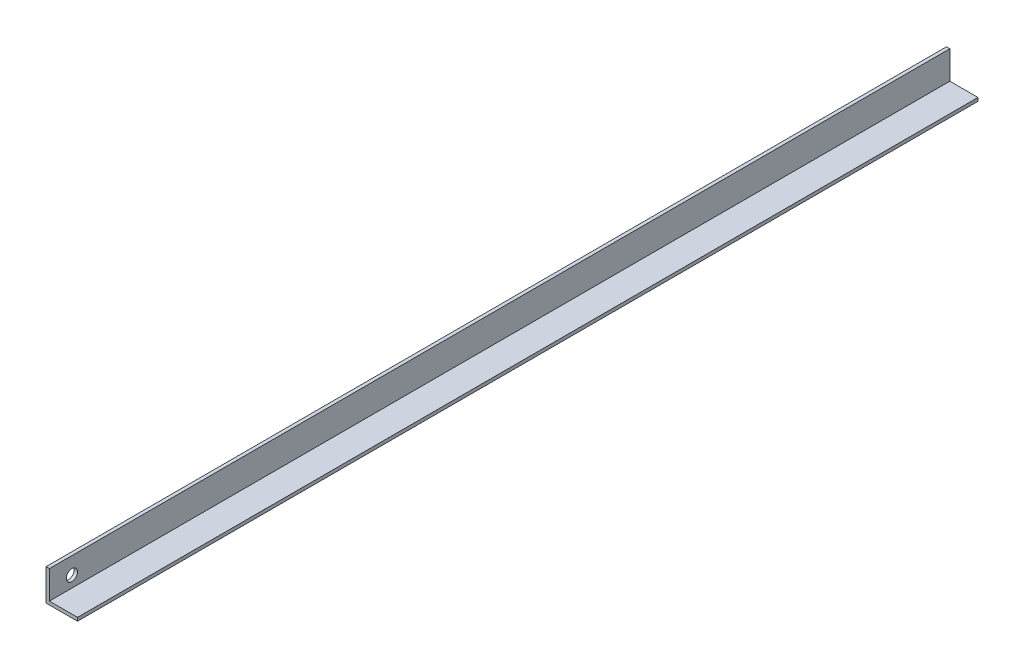
ISO-10303-21;
HEADER;
FILE_DESCRIPTION(('STEP AP214'),'2;1');
FILE_NAME('part.step','',(''),(''),'','','');
FILE_SCHEMA(('AUTOMOTIVE_DESIGN { 1 0 10303 214 1 1 1 1 }'));
ENDSEC;
DATA;
#1=APPLICATION_CONTEXT('core data for automotive mechanical design processes');
#2=APPLICATION_PROTOCOL_DEFINITION('international standard','automotive_design',2000,#1);
#3=PRODUCT_CONTEXT('',#1,'mechanical');
#4=PRODUCT('Part','Part','',(#3));
#5=PRODUCT_RELATED_PRODUCT_CATEGORY('part','',(#4));
#6=PRODUCT_DEFINITION_FORMATION('','',#4);
#7=PRODUCT_DEFINITION_CONTEXT('part definition',#1,'design');
#8=PRODUCT_DEFINITION('design','',#6,#7);
#9=PRODUCT_DEFINITION_SHAPE('','',#8);
#10=(LENGTH_UNIT() NAMED_UNIT(*) SI_UNIT(.MILLI.,.METRE.));
#11=(NAMED_UNIT(*) PLANE_ANGLE_UNIT() SI_UNIT($,.RADIAN.));
#12=(NAMED_UNIT(*) SI_UNIT($,.STERADIAN.) SOLID_ANGLE_UNIT());
#13=UNCERTAINTY_MEASURE_WITH_UNIT(LENGTH_MEASURE(1.E-05),#10,'distance_accuracy_value','');
#14=(GEOMETRIC_REPRESENTATION_CONTEXT(3) GLOBAL_UNCERTAINTY_ASSIGNED_CONTEXT((#13)) GLOBAL_UNIT_ASSIGNED_CONTEXT((#10,
#11,#12)) REPRESENTATION_CONTEXT('',''));
#15=CARTESIAN_POINT('',(0.,0.,0.));
#16=DIRECTION('',(0.,0.,1.));
#17=DIRECTION('',(1.,0.,0.));
#18=AXIS2_PLACEMENT_3D('',#15,#16,#17);
#19=CARTESIAN_POINT('',(0.,-3.,800.));
#20=DIRECTION('',(0.,1.,0.));
#21=DIRECTION('',(0.,0.,1.));
#22=AXIS2_PLACEMENT_3D('',#19,#20,#21);
#23=PLANE('',#22);
#24=DIRECTION('',(1.,0.,0.));
#25=VECTOR('',#24,1.);
#26=CARTESIAN_POINT('',(0.,-3.,0.));
#27=LINE('',#26,#25);
#28=CARTESIAN_POINT('',(-3.,-3.,0.));
#29=VERTEX_POINT('',#28);
#30=CARTESIAN_POINT('',(25.,-3.,0.));
#31=VERTEX_POINT('',#30);
#32=EDGE_CURVE('E114',#29,#31,#27,.T.);
#33=ORIENTED_EDGE('',*,*,#32,.T.);
#34=DIRECTION('',(0.,0.,-1.));
#35=VECTOR('',#34,1.);
#36=CARTESIAN_POINT('',(25.,-3.,800.));
#37=LINE('',#36,#35);
#38=CARTESIAN_POINT('',(25.,-3.,800.));
#39=VERTEX_POINT('',#38);
#40=EDGE_CURVE('E11',#39,#31,#37,.T.);
#41=ORIENTED_EDGE('',*,*,#40,.F.);
#42=DIRECTION('',(1.,0.,0.));
#43=VECTOR('',#42,1.);
#44=CARTESIAN_POINT('',(0.,-3.,800.));
#45=LINE('',#44,#43);
#46=CARTESIAN_POINT('',(-3.,-3.,800.));
#47=VERTEX_POINT('',#46);
#48=EDGE_CURVE('E79',#47,#39,#45,.T.);
#49=ORIENTED_EDGE('',*,*,#48,.F.);
#50=DIRECTION('',(0.,0.,-1.));
#51=VECTOR('',#50,1.);
#52=CARTESIAN_POINT('',(-3.,-3.,800.));
#53=LINE('',#52,#51);
#54=EDGE_CURVE('E110',#47,#29,#53,.T.);
#55=ORIENTED_EDGE('',*,*,#54,.T.);
#56=EDGE_LOOP('',(#33,#41,#49,#55));
#57=FACE_BOUND('',#56,.T.);
#58=ADVANCED_FACE('F33',(#57),#23,.F.);
#59=CARTESIAN_POINT('',(25.,0.,800.));
#60=DIRECTION('',(1.,0.,0.));
#61=DIRECTION('',(0.,0.,-1.));
#62=AXIS2_PLACEMENT_3D('',#59,#60,#61);
#63=PLANE('',#62);
#64=DIRECTION('',(0.,-1.,0.));
#65=VECTOR('',#64,1.);
#66=CARTESIAN_POINT('',(25.,0.,0.));
#67=LINE('',#66,#65);
#68=CARTESIAN_POINT('',(25.,0.,0.));
#69=VERTEX_POINT('',#68);
#70=EDGE_CURVE('E117',#69,#31,#67,.T.);
#71=ORIENTED_EDGE('',*,*,#70,.F.);
#72=DIRECTION('',(0.,0.,-1.));
#73=VECTOR('',#72,1.);
#74=CARTESIAN_POINT('',(25.,0.,800.));
#75=LINE('',#74,#73);
#76=CARTESIAN_POINT('',(25.,0.,800.));
#77=VERTEX_POINT('',#76);
#78=EDGE_CURVE('E41',#77,#69,#75,.T.);
#79=ORIENTED_EDGE('',*,*,#78,.F.);
#80=DIRECTION('',(0.,-1.,0.));
#81=VECTOR('',#80,1.);
#82=CARTESIAN_POINT('',(25.,0.,800.));
#83=LINE('',#82,#81);
#84=EDGE_CURVE('E174',#77,#39,#83,.T.);
#85=ORIENTED_EDGE('',*,*,#84,.T.);
#86=ORIENTED_EDGE('',*,*,#40,.T.);
#87=EDGE_LOOP('',(#71,#79,#85,#86));
#88=FACE_BOUND('',#87,.T.);
#89=ADVANCED_FACE('F136',(#88),#63,.T.);
#90=CARTESIAN_POINT('',(0.,0.,800.));
#91=DIRECTION('',(0.,1.,0.));
#92=DIRECTION('',(0.,0.,1.));
#93=AXIS2_PLACEMENT_3D('',#90,#91,#92);
#94=PLANE('',#93);
#95=DIRECTION('',(1.,0.,0.));
#96=VECTOR('',#95,1.);
#97=CARTESIAN_POINT('',(0.,0.,0.));
#98=LINE('',#97,#96);
#99=CARTESIAN_POINT('',(0.,0.,0.));
#100=VERTEX_POINT('',#99);
#101=EDGE_CURVE('E121',#100,#69,#98,.T.);
#102=ORIENTED_EDGE('',*,*,#101,.F.);
#103=DIRECTION('',(0.,0.,-1.));
#104=VECTOR('',#103,1.);
#105=CARTESIAN_POINT('',(0.,0.,800.));
#106=LINE('',#105,#104);
#107=CARTESIAN_POINT('',(0.,0.,800.));
#108=VERTEX_POINT('',#107);
#109=EDGE_CURVE('E100',#108,#100,#106,.T.);
#110=ORIENTED_EDGE('',*,*,#109,.F.);
#111=DIRECTION('',(1.,0.,0.));
#112=VECTOR('',#111,1.);
#113=CARTESIAN_POINT('',(0.,0.,800.));
#114=LINE('',#113,#112);
#115=EDGE_CURVE('E106',#108,#77,#114,.T.);
#116=ORIENTED_EDGE('',*,*,#115,.T.);
#117=ORIENTED_EDGE('',*,*,#78,.T.);
#118=EDGE_LOOP('',(#102,#110,#116,#117));
#119=FACE_BOUND('',#118,.T.);
#120=ADVANCED_FACE('F133',(#119),#94,.T.);
#121=CARTESIAN_POINT('',(0.,25.,800.));
#122=DIRECTION('',(1.,0.,0.));
#123=DIRECTION('',(0.,1.,0.));
#124=AXIS2_PLACEMENT_3D('',#121,#122,#123);
#125=PLANE('',#124);
#126=CARTESIAN_POINT('',(0.,10.,780.));
#127=DIRECTION('',(1.,0.,0.));
#128=DIRECTION('',(0.,1.,0.));
#129=AXIS2_PLACEMENT_3D('',#126,#127,#128);
#130=CIRCLE('',#129,5.);
#131=CARTESIAN_POINT('',(0.,15.,780.));
#132=VERTEX_POINT('',#131);
#133=EDGE_CURVE('E118',#132,#132,#130,.F.);
#134=ORIENTED_EDGE('',*,*,#133,.T.);
#135=EDGE_LOOP('',(#134));
#136=FACE_BOUND('',#135,.T.);
#137=DIRECTION('',(0.,-1.,0.));
#138=VECTOR('',#137,1.);
#139=CARTESIAN_POINT('',(0.,25.,0.));
#140=LINE('',#139,#138);
#141=CARTESIAN_POINT('',(0.,25.,0.));
#142=VERTEX_POINT('',#141);
#143=EDGE_CURVE('E95',#142,#100,#140,.T.);
#144=ORIENTED_EDGE('',*,*,#143,.F.);
#145=DIRECTION('',(0.,0.,-1.));
#146=VECTOR('',#145,1.);
#147=CARTESIAN_POINT('',(0.,25.,800.));
#148=LINE('',#147,#146);
#149=CARTESIAN_POINT('',(0.,25.,800.));
#150=VERTEX_POINT('',#149);
#151=EDGE_CURVE('E90',#150,#142,#148,.T.);
#152=ORIENTED_EDGE('',*,*,#151,.F.);
#153=DIRECTION('',(0.,-1.,0.));
#154=VECTOR('',#153,1.);
#155=CARTESIAN_POINT('',(0.,25.,800.));
#156=LINE('',#155,#154);
#157=EDGE_CURVE('E93',#150,#108,#156,.T.);
#158=ORIENTED_EDGE('',*,*,#157,.T.);
#159=ORIENTED_EDGE('',*,*,#109,.T.);
#160=EDGE_LOOP('',(#144,#152,#158,#159));
#161=FACE_BOUND('',#160,.T.);
#162=ADVANCED_FACE('F92',(#136,#161),#125,.T.);
#163=CARTESIAN_POINT('',(-3.,25.,800.));
#164=DIRECTION('',(0.,1.,0.));
#165=DIRECTION('',(0.,0.,1.));
#166=AXIS2_PLACEMENT_3D('',#163,#164,#165);
#167=PLANE('',#166);
#168=DIRECTION('',(1.,0.,0.));
#169=VECTOR('',#168,1.);
#170=CARTESIAN_POINT('',(-3.,25.,0.));
#171=LINE('',#170,#169);
#172=CARTESIAN_POINT('',(-3.,25.,0.));
#173=VERTEX_POINT('',#172);
#174=EDGE_CURVE('E125',#173,#142,#171,.T.);
#175=ORIENTED_EDGE('',*,*,#174,.F.);
#176=DIRECTION('',(0.,0.,-1.));
#177=VECTOR('',#176,1.);
#178=CARTESIAN_POINT('',(-3.,25.,800.));
#179=LINE('',#178,#177);
#180=CARTESIAN_POINT('',(-3.,25.,800.));
#181=VERTEX_POINT('',#180);
#182=EDGE_CURVE('E70',#181,#173,#179,.T.);
#183=ORIENTED_EDGE('',*,*,#182,.F.);
#184=DIRECTION('',(1.,0.,0.));
#185=VECTOR('',#184,1.);
#186=CARTESIAN_POINT('',(-3.,25.,800.));
#187=LINE('',#186,#185);
#188=EDGE_CURVE('E104',#181,#150,#187,.T.);
#189=ORIENTED_EDGE('',*,*,#188,.T.);
#190=ORIENTED_EDGE('',*,*,#151,.T.);
#191=EDGE_LOOP('',(#175,#183,#189,#190));
#192=FACE_BOUND('',#191,.T.);
#193=ADVANCED_FACE('F108',(#192),#167,.T.);
#194=CARTESIAN_POINT('',(-3.,25.,800.));
#195=DIRECTION('',(1.,0.,0.));
#196=DIRECTION('',(0.,1.,0.));
#197=AXIS2_PLACEMENT_3D('',#194,#195,#196);
#198=PLANE('',#197);
#199=CARTESIAN_POINT('',(-3.,10.,780.));
#200=DIRECTION('',(1.,0.,0.));
#201=DIRECTION('',(0.,1.,0.));
#202=AXIS2_PLACEMENT_3D('',#199,#200,#201);
#203=CIRCLE('',#202,5.);
#204=CARTESIAN_POINT('',(-3.,15.,780.));
#205=VERTEX_POINT('',#204);
#206=EDGE_CURVE('E169',#205,#205,#203,.T.);
#207=ORIENTED_EDGE('',*,*,#206,.T.);
#208=EDGE_LOOP('',(#207));
#209=FACE_BOUND('',#208,.T.);
#210=DIRECTION('',(0.,-1.,0.));
#211=VECTOR('',#210,1.);
#212=CARTESIAN_POINT('',(-3.,25.,0.));
#213=LINE('',#212,#211);
#214=EDGE_CURVE('E73',#173,#29,#213,.T.);
#215=ORIENTED_EDGE('',*,*,#214,.T.);
#216=ORIENTED_EDGE('',*,*,#54,.F.);
#217=DIRECTION('',(0.,-1.,0.));
#218=VECTOR('',#217,1.);
#219=CARTESIAN_POINT('',(-3.,25.,800.));
#220=LINE('',#219,#218);
#221=EDGE_CURVE('E49',#181,#47,#220,.T.);
#222=ORIENTED_EDGE('',*,*,#221,.F.);
#223=ORIENTED_EDGE('',*,*,#182,.T.);
#224=EDGE_LOOP('',(#215,#216,#222,#223));
#225=FACE_BOUND('',#224,.T.);
#226=ADVANCED_FACE('F141',(#209,#225),#198,.F.);
#227=CARTESIAN_POINT('',(0.,0.,800.));
#228=DIRECTION('',(0.,0.,-1.));
#229=DIRECTION('',(-1.,0.,0.));
#230=AXIS2_PLACEMENT_3D('',#227,#228,#229);
#231=PLANE('',#230);
#232=ORIENTED_EDGE('',*,*,#48,.T.);
#233=ORIENTED_EDGE('',*,*,#84,.F.);
#234=ORIENTED_EDGE('',*,*,#115,.F.);
#235=ORIENTED_EDGE('',*,*,#157,.F.);
#236=ORIENTED_EDGE('',*,*,#188,.F.);
#237=ORIENTED_EDGE('',*,*,#221,.T.);
#238=EDGE_LOOP('',(#232,#233,#234,#235,#236,#237));
#239=FACE_BOUND('',#238,.T.);
#240=ADVANCED_FACE('F103',(#239),#231,.F.);
#241=CARTESIAN_POINT('',(0.,0.,0.));
#242=DIRECTION('',(0.,0.,-1.));
#243=DIRECTION('',(-1.,0.,0.));
#244=AXIS2_PLACEMENT_3D('',#241,#242,#243);
#245=PLANE('',#244);
#246=ORIENTED_EDGE('',*,*,#32,.F.);
#247=ORIENTED_EDGE('',*,*,#214,.F.);
#248=ORIENTED_EDGE('',*,*,#174,.T.);
#249=ORIENTED_EDGE('',*,*,#143,.T.);
#250=ORIENTED_EDGE('',*,*,#101,.T.);
#251=ORIENTED_EDGE('',*,*,#70,.T.);
#252=EDGE_LOOP('',(#246,#247,#248,#249,#250,#251));
#253=FACE_BOUND('',#252,.T.);
#254=ADVANCED_FACE('F139',(#253),#245,.T.);
#255=CARTESIAN_POINT('',(7.,10.,780.));
#256=DIRECTION('',(-1.,0.,0.));
#257=DIRECTION('',(0.,-1.,0.));
#258=AXIS2_PLACEMENT_3D('',#255,#256,#257);
#259=CYLINDRICAL_SURFACE('',#258,5.);
#260=ORIENTED_EDGE('',*,*,#133,.F.);
#261=EDGE_LOOP('',(#260));
#262=FACE_BOUND('',#261,.T.);
#263=ORIENTED_EDGE('',*,*,#206,.F.);
#264=EDGE_LOOP('',(#263));
#265=FACE_BOUND('',#264,.T.);
#266=ADVANCED_FACE('F177',(#262,#265),#259,.F.);
#267=CLOSED_SHELL('',(#58,#89,#120,#162,#193,#226,#240,#254,#266));
#268=MANIFOLD_SOLID_BREP('B2',#267);
#269=ADVANCED_BREP_SHAPE_REPRESENTATION('',(#18,#268),#14);
#270=SHAPE_DEFINITION_REPRESENTATION(#9,#269);
ENDSEC;
END-ISO-10303-21;
